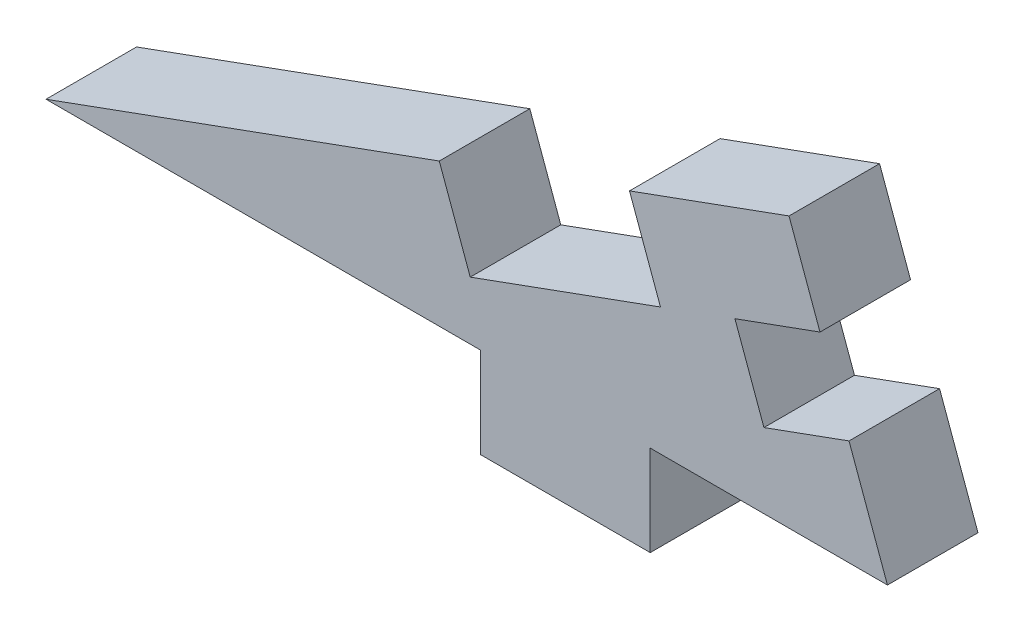
ISO-10303-21;
HEADER;
FILE_DESCRIPTION(('STEP AP214'),'2;1');
FILE_NAME('part.step','',(''),(''),'','','');
FILE_SCHEMA(('AUTOMOTIVE_DESIGN { 1 0 10303 214 1 1 1 1 }'));
ENDSEC;
DATA;
#1=APPLICATION_CONTEXT('core data for automotive mechanical design processes');
#2=APPLICATION_PROTOCOL_DEFINITION('international standard','automotive_design',2000,#1);
#3=PRODUCT_CONTEXT('',#1,'mechanical');
#4=PRODUCT('Part','Part','',(#3));
#5=PRODUCT_RELATED_PRODUCT_CATEGORY('part','',(#4));
#6=PRODUCT_DEFINITION_FORMATION('','',#4);
#7=PRODUCT_DEFINITION_CONTEXT('part definition',#1,'design');
#8=PRODUCT_DEFINITION('design','',#6,#7);
#9=PRODUCT_DEFINITION_SHAPE('','',#8);
#10=(LENGTH_UNIT() NAMED_UNIT(*) SI_UNIT(.MILLI.,.METRE.));
#11=(NAMED_UNIT(*) PLANE_ANGLE_UNIT() SI_UNIT($,.RADIAN.));
#12=(NAMED_UNIT(*) SI_UNIT($,.STERADIAN.) SOLID_ANGLE_UNIT());
#13=UNCERTAINTY_MEASURE_WITH_UNIT(LENGTH_MEASURE(1.E-05),#10,'distance_accuracy_value','');
#14=(GEOMETRIC_REPRESENTATION_CONTEXT(3) GLOBAL_UNCERTAINTY_ASSIGNED_CONTEXT((#13)) GLOBAL_UNIT_ASSIGNED_CONTEXT((#10,
#11,#12)) REPRESENTATION_CONTEXT('',''));
#15=CARTESIAN_POINT('',(0.,0.,0.));
#16=DIRECTION('',(0.,0.,1.));
#17=DIRECTION('',(1.,0.,0.));
#18=AXIS2_PLACEMENT_3D('',#15,#16,#17);
#19=CARTESIAN_POINT('',(28.575,10.4004494441567,5.08));
#20=DIRECTION('',(-0.939692620785908,-0.342020143325669,0.));
#21=DIRECTION('',(0.342020143325669,-0.939692620785909,0.));
#22=AXIS2_PLACEMENT_3D('',#19,#20,#21);
#23=PLANE('',#22);
#24=DIRECTION('',(-0.342020143325669,0.939692620785909,0.));
#25=VECTOR('',#24,1.);
#26=CARTESIAN_POINT('',(28.575,10.4004494441567,5.08));
#27=LINE('',#26,#25);
#28=CARTESIAN_POINT('',(28.575,10.4004494441568,5.08));
#29=VERTEX_POINT('',#28);
#30=CARTESIAN_POINT('',(26.8375376719056,15.1740879577492,5.08));
#31=VERTEX_POINT('',#30);
#32=EDGE_CURVE('E215',#29,#31,#27,.T.);
#33=ORIENTED_EDGE('',*,*,#32,.F.);
#34=DIRECTION('',(0.,0.,1.));
#35=VECTOR('',#34,1.);
#36=CARTESIAN_POINT('',(28.575,10.4004494441568,0.));
#37=LINE('',#36,#35);
#38=CARTESIAN_POINT('',(28.575,10.4004494441568,0.));
#39=VERTEX_POINT('',#38);
#40=EDGE_CURVE('E248',#39,#29,#37,.T.);
#41=ORIENTED_EDGE('',*,*,#40,.F.);
#42=DIRECTION('',(-0.342020143325669,0.939692620785909,0.));
#43=VECTOR('',#42,1.);
#44=CARTESIAN_POINT('',(28.575,10.4004494441567,0.));
#45=LINE('',#44,#43);
#46=CARTESIAN_POINT('',(26.8375376719056,15.1740879577492,0.));
#47=VERTEX_POINT('',#46);
#48=EDGE_CURVE('E170',#39,#47,#45,.T.);
#49=ORIENTED_EDGE('',*,*,#48,.T.);
#50=DIRECTION('',(0.,0.,-1.));
#51=VECTOR('',#50,1.);
#52=CARTESIAN_POINT('',(26.8375376719056,15.1740879577492,5.08));
#53=LINE('',#52,#51);
#54=EDGE_CURVE('E185',#31,#47,#53,.T.);
#55=ORIENTED_EDGE('',*,*,#54,.F.);
#56=EDGE_LOOP('',(#33,#41,#49,#55));
#57=FACE_BOUND('',#56,.T.);
#58=ADVANCED_FACE('F35',(#57),#23,.F.);
#59=CARTESIAN_POINT('',(0.,0.,5.08));
#60=DIRECTION('',(0.,1.,0.));
#61=DIRECTION('',(0.,0.,1.));
#62=AXIS2_PLACEMENT_3D('',#59,#60,#61);
#63=PLANE('',#62);
#64=DIRECTION('',(1.,0.,0.));
#65=VECTOR('',#64,1.);
#66=CARTESIAN_POINT('',(0.,0.,0.));
#67=LINE('',#66,#65);
#68=CARTESIAN_POINT('',(-14.8529263528285,0.,0.));
#69=VERTEX_POINT('',#68);
#70=CARTESIAN_POINT('',(9.525,0.,0.));
#71=VERTEX_POINT('',#70);
#72=EDGE_CURVE('E153',#69,#71,#67,.T.);
#73=ORIENTED_EDGE('',*,*,#72,.T.);
#74=DIRECTION('',(0.,0.,-1.));
#75=VECTOR('',#74,1.);
#76=CARTESIAN_POINT('',(9.525,0.,5.08));
#77=LINE('',#76,#75);
#78=CARTESIAN_POINT('',(9.525,0.,5.08));
#79=VERTEX_POINT('',#78);
#80=EDGE_CURVE('E11',#79,#71,#77,.T.);
#81=ORIENTED_EDGE('',*,*,#80,.F.);
#82=DIRECTION('',(1.,0.,0.));
#83=VECTOR('',#82,1.);
#84=CARTESIAN_POINT('',(0.,0.,5.08));
#85=LINE('',#84,#83);
#86=CARTESIAN_POINT('',(-14.8529263528285,0.,5.08));
#87=VERTEX_POINT('',#86);
#88=EDGE_CURVE('E181',#87,#79,#85,.T.);
#89=ORIENTED_EDGE('',*,*,#88,.F.);
#90=DIRECTION('',(0.,0.,1.));
#91=VECTOR('',#90,1.);
#92=CARTESIAN_POINT('',(-14.8529263528285,0.,-15.6011873234379));
#93=LINE('',#92,#91);
#94=EDGE_CURVE('E242',#69,#87,#93,.T.);
#95=ORIENTED_EDGE('',*,*,#94,.F.);
#96=EDGE_LOOP('',(#73,#81,#89,#95));
#97=FACE_BOUND('',#96,.T.);
#98=ADVANCED_FACE('F259',(#97),#63,.F.);
#99=CARTESIAN_POINT('',(9.525,0.,5.08));
#100=DIRECTION('',(1.,0.,0.));
#101=DIRECTION('',(0.,0.,-1.));
#102=AXIS2_PLACEMENT_3D('',#99,#100,#101);
#103=PLANE('',#102);
#104=DIRECTION('',(0.,-1.,0.));
#105=VECTOR('',#104,1.);
#106=CARTESIAN_POINT('',(9.525,0.,0.));
#107=LINE('',#106,#105);
#108=CARTESIAN_POINT('',(9.525,-5.08,0.));
#109=VERTEX_POINT('',#108);
#110=EDGE_CURVE('E156',#71,#109,#107,.T.);
#111=ORIENTED_EDGE('',*,*,#110,.T.);
#112=DIRECTION('',(0.,0.,-1.));
#113=VECTOR('',#112,1.);
#114=CARTESIAN_POINT('',(9.525,-5.08,5.08));
#115=LINE('',#114,#113);
#116=CARTESIAN_POINT('',(9.525,-5.08,5.08));
#117=VERTEX_POINT('',#116);
#118=EDGE_CURVE('E43',#117,#109,#115,.T.);
#119=ORIENTED_EDGE('',*,*,#118,.F.);
#120=DIRECTION('',(0.,-1.,0.));
#121=VECTOR('',#120,1.);
#122=CARTESIAN_POINT('',(9.525,0.,5.08));
#123=LINE('',#122,#121);
#124=EDGE_CURVE('E101',#79,#117,#123,.T.);
#125=ORIENTED_EDGE('',*,*,#124,.F.);
#126=ORIENTED_EDGE('',*,*,#80,.T.);
#127=EDGE_LOOP('',(#111,#119,#125,#126));
#128=FACE_BOUND('',#127,.T.);
#129=ADVANCED_FACE('F37',(#128),#103,.F.);
#130=CARTESIAN_POINT('',(0.,-5.08,5.08));
#131=DIRECTION('',(0.,1.,0.));
#132=DIRECTION('',(-1.,0.,0.));
#133=AXIS2_PLACEMENT_3D('',#130,#131,#132);
#134=PLANE('',#133);
#135=DIRECTION('',(1.,0.,0.));
#136=VECTOR('',#135,1.);
#137=CARTESIAN_POINT('',(0.,-5.08,0.));
#138=LINE('',#137,#136);
#139=CARTESIAN_POINT('',(19.05,-5.08,0.));
#140=VERTEX_POINT('',#139);
#141=EDGE_CURVE('E160',#109,#140,#138,.T.);
#142=ORIENTED_EDGE('',*,*,#141,.T.);
#143=DIRECTION('',(0.,0.,-1.));
#144=VECTOR('',#143,1.);
#145=CARTESIAN_POINT('',(19.05,-5.08,5.08));
#146=LINE('',#145,#144);
#147=CARTESIAN_POINT('',(19.05,-5.08,5.08));
#148=VERTEX_POINT('',#147);
#149=EDGE_CURVE('E190',#148,#140,#146,.T.);
#150=ORIENTED_EDGE('',*,*,#149,.F.);
#151=DIRECTION('',(1.,0.,0.));
#152=VECTOR('',#151,1.);
#153=CARTESIAN_POINT('',(0.,-5.08,5.08));
#154=LINE('',#153,#152);
#155=EDGE_CURVE('E197',#117,#148,#154,.T.);
#156=ORIENTED_EDGE('',*,*,#155,.F.);
#157=ORIENTED_EDGE('',*,*,#118,.T.);
#158=EDGE_LOOP('',(#142,#150,#156,#157));
#159=FACE_BOUND('',#158,.T.);
#160=ADVANCED_FACE('F195',(#159),#134,.F.);
#161=CARTESIAN_POINT('',(19.05,0.,5.08));
#162=DIRECTION('',(1.,0.,0.));
#163=DIRECTION('',(0.,0.,-1.));
#164=AXIS2_PLACEMENT_3D('',#161,#162,#163);
#165=PLANE('',#164);
#166=DIRECTION('',(0.,-1.,0.));
#167=VECTOR('',#166,1.);
#168=CARTESIAN_POINT('',(19.05,0.,0.));
#169=LINE('',#168,#167);
#170=CARTESIAN_POINT('',(19.05,0.,0.));
#171=VERTEX_POINT('',#170);
#172=EDGE_CURVE('E163',#171,#140,#169,.T.);
#173=ORIENTED_EDGE('',*,*,#172,.F.);
#174=DIRECTION('',(0.,0.,-1.));
#175=VECTOR('',#174,1.);
#176=CARTESIAN_POINT('',(19.05,0.,5.08));
#177=LINE('',#176,#175);
#178=CARTESIAN_POINT('',(19.05,0.,5.08));
#179=VERTEX_POINT('',#178);
#180=EDGE_CURVE('E188',#179,#171,#177,.T.);
#181=ORIENTED_EDGE('',*,*,#180,.F.);
#182=DIRECTION('',(0.,-1.,0.));
#183=VECTOR('',#182,1.);
#184=CARTESIAN_POINT('',(19.05,0.,5.08));
#185=LINE('',#184,#183);
#186=EDGE_CURVE('E211',#179,#148,#185,.T.);
#187=ORIENTED_EDGE('',*,*,#186,.T.);
#188=ORIENTED_EDGE('',*,*,#149,.T.);
#189=EDGE_LOOP('',(#173,#181,#187,#188));
#190=FACE_BOUND('',#189,.T.);
#191=ADVANCED_FACE('F207',(#190),#165,.T.);
#192=CARTESIAN_POINT('',(32.3604540206635,0.,0.));
#193=VERTEX_POINT('',#192);
#194=EDGE_CURVE('E158',#171,#193,#67,.T.);
#195=ORIENTED_EDGE('',*,*,#194,.T.);
#196=DIRECTION('',(0.,0.,1.));
#197=VECTOR('',#196,1.);
#198=CARTESIAN_POINT('',(32.3604540206635,0.,-15.6011873234379));
#199=LINE('',#198,#197);
#200=CARTESIAN_POINT('',(32.3604540206635,0.,5.08));
#201=VERTEX_POINT('',#200);
#202=EDGE_CURVE('E157',#193,#201,#199,.T.);
#203=ORIENTED_EDGE('',*,*,#202,.T.);
#204=EDGE_CURVE('E213',#179,#201,#85,.T.);
#205=ORIENTED_EDGE('',*,*,#204,.F.);
#206=ORIENTED_EDGE('',*,*,#180,.T.);
#207=EDGE_LOOP('',(#195,#203,#205,#206));
#208=FACE_BOUND('',#207,.T.);
#209=ADVANCED_FACE('F266',(#208),#63,.F.);
#210=CARTESIAN_POINT('',(30.2038709325885,5.92516333766385,0.));
#211=VERTEX_POINT('',#210);
#212=EDGE_CURVE('E166',#193,#211,#45,.T.);
#213=ORIENTED_EDGE('',*,*,#212,.T.);
#214=DIRECTION('',(0.,0.,1.));
#215=VECTOR('',#214,1.);
#216=CARTESIAN_POINT('',(30.2038709325885,5.92516333766385,0.));
#217=LINE('',#216,#215);
#218=CARTESIAN_POINT('',(30.2038709325885,5.92516333766385,5.08));
#219=VERTEX_POINT('',#218);
#220=EDGE_CURVE('E253',#211,#219,#217,.T.);
#221=ORIENTED_EDGE('',*,*,#220,.T.);
#222=EDGE_CURVE('E220',#201,#219,#27,.T.);
#223=ORIENTED_EDGE('',*,*,#222,.F.);
#224=ORIENTED_EDGE('',*,*,#202,.F.);
#225=EDGE_LOOP('',(#213,#221,#223,#224));
#226=FACE_BOUND('',#225,.T.);
#227=ADVANCED_FACE('F269',(#226),#23,.F.);
#228=CARTESIAN_POINT('',(-1.7374623280944,4.77363851359242,5.08));
#229=DIRECTION('',(0.342020143325669,-0.939692620785908,0.));
#230=DIRECTION('',(0.939692620785908,0.342020143325669,0.));
#231=AXIS2_PLACEMENT_3D('',#228,#229,#230);
#232=PLANE('',#231);
#233=DIRECTION('',(-0.939692620785908,-0.342020143325669,0.));
#234=VECTOR('',#233,1.);
#235=CARTESIAN_POINT('',(-1.7374623280944,4.77363851359242,0.));
#236=LINE('',#235,#234);
#237=CARTESIAN_POINT('',(17.8869654589198,11.9163460925722,0.));
#238=VERTEX_POINT('',#237);
#239=EDGE_CURVE('E169',#47,#238,#236,.T.);
#240=ORIENTED_EDGE('',*,*,#239,.T.);
#241=DIRECTION('',(0.,0.,-1.));
#242=VECTOR('',#241,1.);
#243=CARTESIAN_POINT('',(17.8869654589198,11.9163460925722,5.08));
#244=LINE('',#243,#242);
#245=CARTESIAN_POINT('',(17.8869654589198,11.9163460925722,5.08));
#246=VERTEX_POINT('',#245);
#247=EDGE_CURVE('E142',#246,#238,#244,.T.);
#248=ORIENTED_EDGE('',*,*,#247,.F.);
#249=DIRECTION('',(-0.939692620785908,-0.342020143325669,0.));
#250=VECTOR('',#249,1.);
#251=CARTESIAN_POINT('',(-1.7374623280944,4.77363851359242,5.08));
#252=LINE('',#251,#250);
#253=EDGE_CURVE('E129',#31,#246,#252,.T.);
#254=ORIENTED_EDGE('',*,*,#253,.F.);
#255=ORIENTED_EDGE('',*,*,#54,.T.);
#256=EDGE_LOOP('',(#240,#248,#254,#255));
#257=FACE_BOUND('',#256,.T.);
#258=ADVANCED_FACE('F235',(#257),#232,.F.);
#259=CARTESIAN_POINT('',(19.6244277870142,7.14270757897975,5.08));
#260=DIRECTION('',(0.939692620785908,0.342020143325669,0.));
#261=DIRECTION('',(-0.342020143325669,0.939692620785908,0.));
#262=AXIS2_PLACEMENT_3D('',#259,#260,#261);
#263=PLANE('',#262);
#264=DIRECTION('',(0.342020143325669,-0.939692620785908,0.));
#265=VECTOR('',#264,1.);
#266=CARTESIAN_POINT('',(19.6244277870142,7.14270757897975,0.));
#267=LINE('',#266,#265);
#268=CARTESIAN_POINT('',(19.6244277870142,7.14270757897975,0.));
#269=VERTEX_POINT('',#268);
#270=EDGE_CURVE('E138',#238,#269,#267,.T.);
#271=ORIENTED_EDGE('',*,*,#270,.T.);
#272=DIRECTION('',(0.,0.,-1.));
#273=VECTOR('',#272,1.);
#274=CARTESIAN_POINT('',(19.6244277870142,7.14270757897975,5.08));
#275=LINE('',#274,#273);
#276=CARTESIAN_POINT('',(19.6244277870142,7.14270757897975,5.08));
#277=VERTEX_POINT('',#276);
#278=EDGE_CURVE('E135',#277,#269,#275,.T.);
#279=ORIENTED_EDGE('',*,*,#278,.F.);
#280=DIRECTION('',(0.342020143325669,-0.939692620785908,0.));
#281=VECTOR('',#280,1.);
#282=CARTESIAN_POINT('',(19.6244277870142,7.14270757897975,5.08));
#283=LINE('',#282,#281);
#284=EDGE_CURVE('E122',#246,#277,#283,.T.);
#285=ORIENTED_EDGE('',*,*,#284,.F.);
#286=ORIENTED_EDGE('',*,*,#247,.T.);
#287=EDGE_LOOP('',(#271,#279,#285,#286));
#288=FACE_BOUND('',#287,.T.);
#289=ADVANCED_FACE('F136',(#288),#263,.F.);
#290=CARTESIAN_POINT('',(0.,0.,5.08));
#291=DIRECTION('',(-0.342020143325669,0.939692620785908,0.));
#292=DIRECTION('',(-0.939692620785908,-0.342020143325669,0.));
#293=AXIS2_PLACEMENT_3D('',#290,#291,#292);
#294=PLANE('',#293);
#295=DIRECTION('',(0.939692620785908,0.342020143325669,0.));
#296=VECTOR('',#295,1.);
#297=CARTESIAN_POINT('',(0.,0.,0.));
#298=LINE('',#297,#296);
#299=CARTESIAN_POINT('',(8.95057221298578,3.257741865177,0.));
#300=VERTEX_POINT('',#299);
#301=EDGE_CURVE('E173',#300,#269,#298,.T.);
#302=ORIENTED_EDGE('',*,*,#301,.F.);
#303=DIRECTION('',(0.,0.,-1.));
#304=VECTOR('',#303,1.);
#305=CARTESIAN_POINT('',(8.95057221298578,3.257741865177,5.08));
#306=LINE('',#305,#304);
#307=CARTESIAN_POINT('',(8.95057221298578,3.257741865177,5.08));
#308=VERTEX_POINT('',#307);
#309=EDGE_CURVE('E143',#308,#300,#306,.T.);
#310=ORIENTED_EDGE('',*,*,#309,.F.);
#311=DIRECTION('',(0.939692620785908,0.342020143325669,0.));
#312=VECTOR('',#311,1.);
#313=CARTESIAN_POINT('',(0.,0.,5.08));
#314=LINE('',#313,#312);
#315=EDGE_CURVE('E127',#308,#277,#314,.T.);
#316=ORIENTED_EDGE('',*,*,#315,.T.);
#317=ORIENTED_EDGE('',*,*,#278,.T.);
#318=EDGE_LOOP('',(#302,#310,#316,#317));
#319=FACE_BOUND('',#318,.T.);
#320=ADVANCED_FACE('F145',(#319),#294,.T.);
#321=CARTESIAN_POINT('',(8.95057221298578,3.257741865177,5.08));
#322=DIRECTION('',(0.939692620785908,0.342020143325669,0.));
#323=DIRECTION('',(-0.342020143325669,0.939692620785908,0.));
#324=AXIS2_PLACEMENT_3D('',#321,#322,#323);
#325=PLANE('',#324);
#326=DIRECTION('',(0.342020143325669,-0.939692620785908,0.));
#327=VECTOR('',#326,1.);
#328=CARTESIAN_POINT('',(8.95057221298578,3.257741865177,0.));
#329=LINE('',#328,#327);
#330=CARTESIAN_POINT('',(7.21310988489138,8.03138037876941,0.));
#331=VERTEX_POINT('',#330);
#332=EDGE_CURVE('E175',#331,#300,#329,.T.);
#333=ORIENTED_EDGE('',*,*,#332,.F.);
#334=DIRECTION('',(0.,0.,-1.));
#335=VECTOR('',#334,1.);
#336=CARTESIAN_POINT('',(7.21310988489138,8.03138037876941,5.08));
#337=LINE('',#336,#335);
#338=CARTESIAN_POINT('',(7.21310988489138,8.03138037876941,5.08));
#339=VERTEX_POINT('',#338);
#340=EDGE_CURVE('E59',#339,#331,#337,.T.);
#341=ORIENTED_EDGE('',*,*,#340,.F.);
#342=DIRECTION('',(0.342020143325669,-0.939692620785908,0.));
#343=VECTOR('',#342,1.);
#344=CARTESIAN_POINT('',(8.95057221298578,3.257741865177,5.08));
#345=LINE('',#344,#343);
#346=EDGE_CURVE('E146',#339,#308,#345,.T.);
#347=ORIENTED_EDGE('',*,*,#346,.T.);
#348=ORIENTED_EDGE('',*,*,#309,.T.);
#349=EDGE_LOOP('',(#333,#341,#347,#348));
#350=FACE_BOUND('',#349,.T.);
#351=ADVANCED_FACE('F236',(#350),#325,.T.);
#352=CARTESIAN_POINT('',(-1.7374623280944,4.77363851359241,5.08));
#353=DIRECTION('',(-0.342020143325669,0.939692620785908,0.));
#354=DIRECTION('',(-0.939692620785908,-0.342020143325669,0.));
#355=AXIS2_PLACEMENT_3D('',#352,#353,#354);
#356=PLANE('',#355);
#357=DIRECTION('',(0.939692620785908,0.342020143325669,0.));
#358=VECTOR('',#357,1.);
#359=CARTESIAN_POINT('',(-1.7374623280944,4.77363851359241,0.));
#360=LINE('',#359,#358);
#361=EDGE_CURVE('E178',#69,#331,#360,.T.);
#362=ORIENTED_EDGE('',*,*,#361,.F.);
#363=ORIENTED_EDGE('',*,*,#94,.T.);
#364=DIRECTION('',(0.939692620785908,0.342020143325669,0.));
#365=VECTOR('',#364,1.);
#366=CARTESIAN_POINT('',(-1.7374623280944,4.77363851359241,5.08));
#367=LINE('',#366,#365);
#368=EDGE_CURVE('E148',#87,#339,#367,.T.);
#369=ORIENTED_EDGE('',*,*,#368,.T.);
#370=ORIENTED_EDGE('',*,*,#340,.T.);
#371=EDGE_LOOP('',(#362,#363,#369,#370));
#372=FACE_BOUND('',#371,.T.);
#373=ADVANCED_FACE('F240',(#372),#356,.T.);
#374=CARTESIAN_POINT('',(0.,0.,5.08));
#375=DIRECTION('',(0.,0.,1.));
#376=DIRECTION('',(1.,0.,0.));
#377=AXIS2_PLACEMENT_3D('',#374,#375,#376);
#378=PLANE('',#377);
#379=DIRECTION('',(-0.939692620785908,-0.342020143325669,0.));
#380=VECTOR('',#379,1.);
#381=CARTESIAN_POINT('',(28.575,10.4004494441568,5.08));
#382=LINE('',#381,#380);
#383=CARTESIAN_POINT('',(23.8013614864075,8.66298711606233,5.08));
#384=VERTEX_POINT('',#383);
#385=EDGE_CURVE('E230',#29,#384,#382,.T.);
#386=ORIENTED_EDGE('',*,*,#385,.F.);
#387=ORIENTED_EDGE('',*,*,#32,.T.);
#388=ORIENTED_EDGE('',*,*,#253,.T.);
#389=ORIENTED_EDGE('',*,*,#284,.T.);
#390=ORIENTED_EDGE('',*,*,#315,.F.);
#391=ORIENTED_EDGE('',*,*,#346,.F.);
#392=ORIENTED_EDGE('',*,*,#368,.F.);
#393=ORIENTED_EDGE('',*,*,#88,.T.);
#394=ORIENTED_EDGE('',*,*,#124,.T.);
#395=ORIENTED_EDGE('',*,*,#155,.T.);
#396=ORIENTED_EDGE('',*,*,#186,.F.);
#397=ORIENTED_EDGE('',*,*,#204,.T.);
#398=ORIENTED_EDGE('',*,*,#222,.T.);
#399=DIRECTION('',(0.939692620785908,0.342020143325669,0.));
#400=VECTOR('',#399,1.);
#401=CARTESIAN_POINT('',(30.2038709325885,5.92516333766385,5.08));
#402=LINE('',#401,#400);
#403=CARTESIAN_POINT('',(25.430232418996,4.18770100956946,5.08));
#404=VERTEX_POINT('',#403);
#405=EDGE_CURVE('E311',#404,#219,#402,.T.);
#406=ORIENTED_EDGE('',*,*,#405,.F.);
#407=DIRECTION('',(0.342020143325677,-0.939692620785905,0.));
#408=VECTOR('',#407,1.);
#409=CARTESIAN_POINT('',(23.8013614864075,8.66298711606233,5.08));
#410=LINE('',#409,#408);
#411=EDGE_CURVE('E313',#384,#404,#410,.T.);
#412=ORIENTED_EDGE('',*,*,#411,.F.);
#413=EDGE_LOOP('',(#386,#387,#388,#389,#390,#391,#392,#393,#394,#395,#396,#397,#398,#406,#412));
#414=FACE_BOUND('',#413,.T.);
#415=ADVANCED_FACE('F125',(#414),#378,.T.);
#416=CARTESIAN_POINT('',(0.,0.,0.));
#417=DIRECTION('',(0.,0.,1.));
#418=DIRECTION('',(1.,0.,0.));
#419=AXIS2_PLACEMENT_3D('',#416,#417,#418);
#420=PLANE('',#419);
#421=ORIENTED_EDGE('',*,*,#48,.F.);
#422=DIRECTION('',(-0.939692620785908,-0.342020143325669,0.));
#423=VECTOR('',#422,1.);
#424=CARTESIAN_POINT('',(28.575,10.4004494441568,0.));
#425=LINE('',#424,#423);
#426=CARTESIAN_POINT('',(23.8013614864075,8.66298711606233,0.));
#427=VERTEX_POINT('',#426);
#428=EDGE_CURVE('E304',#39,#427,#425,.T.);
#429=ORIENTED_EDGE('',*,*,#428,.T.);
#430=DIRECTION('',(0.342020143325677,-0.939692620785905,0.));
#431=VECTOR('',#430,1.);
#432=CARTESIAN_POINT('',(23.8013614864075,8.66298711606233,0.));
#433=LINE('',#432,#431);
#434=CARTESIAN_POINT('',(25.430232418996,4.18770100956946,0.));
#435=VERTEX_POINT('',#434);
#436=EDGE_CURVE('E308',#427,#435,#433,.T.);
#437=ORIENTED_EDGE('',*,*,#436,.T.);
#438=DIRECTION('',(0.939692620785908,0.342020143325669,0.));
#439=VECTOR('',#438,1.);
#440=CARTESIAN_POINT('',(30.2038709325885,5.92516333766385,0.));
#441=LINE('',#440,#439);
#442=EDGE_CURVE('E50',#435,#211,#441,.T.);
#443=ORIENTED_EDGE('',*,*,#442,.T.);
#444=ORIENTED_EDGE('',*,*,#212,.F.);
#445=ORIENTED_EDGE('',*,*,#194,.F.);
#446=ORIENTED_EDGE('',*,*,#172,.T.);
#447=ORIENTED_EDGE('',*,*,#141,.F.);
#448=ORIENTED_EDGE('',*,*,#110,.F.);
#449=ORIENTED_EDGE('',*,*,#72,.F.);
#450=ORIENTED_EDGE('',*,*,#361,.T.);
#451=ORIENTED_EDGE('',*,*,#332,.T.);
#452=ORIENTED_EDGE('',*,*,#301,.T.);
#453=ORIENTED_EDGE('',*,*,#270,.F.);
#454=ORIENTED_EDGE('',*,*,#239,.F.);
#455=EDGE_LOOP('',(#421,#429,#437,#443,#444,#445,#446,#447,#448,#449,#450,#451,#452,#453,#454));
#456=FACE_BOUND('',#455,.T.);
#457=ADVANCED_FACE('F200',(#456),#420,.F.);
#458=CARTESIAN_POINT('',(28.575,10.4004494441568,0.));
#459=DIRECTION('',(-0.342020143325669,0.939692620785908,0.));
#460=DIRECTION('',(-0.939692620785908,-0.342020143325669,0.));
#461=AXIS2_PLACEMENT_3D('',#458,#459,#460);
#462=PLANE('',#461);
#463=ORIENTED_EDGE('',*,*,#385,.T.);
#464=DIRECTION('',(0.,0.,1.));
#465=VECTOR('',#464,1.);
#466=CARTESIAN_POINT('',(23.8013614864075,8.66298711606233,0.));
#467=LINE('',#466,#465);
#468=EDGE_CURVE('E256',#427,#384,#467,.T.);
#469=ORIENTED_EDGE('',*,*,#468,.F.);
#470=ORIENTED_EDGE('',*,*,#428,.F.);
#471=ORIENTED_EDGE('',*,*,#40,.T.);
#472=EDGE_LOOP('',(#463,#469,#470,#471));
#473=FACE_BOUND('',#472,.T.);
#474=ADVANCED_FACE('F302',(#473),#462,.F.);
#475=CARTESIAN_POINT('',(30.2038709325885,5.92516333766385,0.));
#476=DIRECTION('',(0.342020143325669,-0.939692620785908,0.));
#477=DIRECTION('',(0.939692620785908,0.342020143325669,0.));
#478=AXIS2_PLACEMENT_3D('',#475,#476,#477);
#479=PLANE('',#478);
#480=ORIENTED_EDGE('',*,*,#405,.T.);
#481=ORIENTED_EDGE('',*,*,#220,.F.);
#482=ORIENTED_EDGE('',*,*,#442,.F.);
#483=DIRECTION('',(0.,0.,1.));
#484=VECTOR('',#483,1.);
#485=CARTESIAN_POINT('',(25.430232418996,4.18770100956946,0.));
#486=LINE('',#485,#484);
#487=EDGE_CURVE('E307',#435,#404,#486,.T.);
#488=ORIENTED_EDGE('',*,*,#487,.T.);
#489=EDGE_LOOP('',(#480,#481,#482,#488));
#490=FACE_BOUND('',#489,.T.);
#491=ADVANCED_FACE('F319',(#490),#479,.F.);
#492=CARTESIAN_POINT('',(23.8013614864075,8.66298711606233,0.));
#493=DIRECTION('',(-0.939692620785905,-0.342020143325677,0.));
#494=DIRECTION('',(0.342020143325677,-0.939692620785905,0.));
#495=AXIS2_PLACEMENT_3D('',#492,#493,#494);
#496=PLANE('',#495);
#497=ORIENTED_EDGE('',*,*,#411,.T.);
#498=ORIENTED_EDGE('',*,*,#487,.F.);
#499=ORIENTED_EDGE('',*,*,#436,.F.);
#500=ORIENTED_EDGE('',*,*,#468,.T.);
#501=EDGE_LOOP('',(#497,#498,#499,#500));
#502=FACE_BOUND('',#501,.T.);
#503=ADVANCED_FACE('F309',(#502),#496,.F.);
#504=CLOSED_SHELL('',(#58,#98,#129,#160,#191,#209,#227,#258,#289,#320,#351,#373,#415,#457,#474,
#491,#503));
#505=MANIFOLD_SOLID_BREP('B2',#504);
#506=ADVANCED_BREP_SHAPE_REPRESENTATION('',(#18,#505),#14);
#507=SHAPE_DEFINITION_REPRESENTATION(#9,#506);
ENDSEC;
END-ISO-10303-21;
